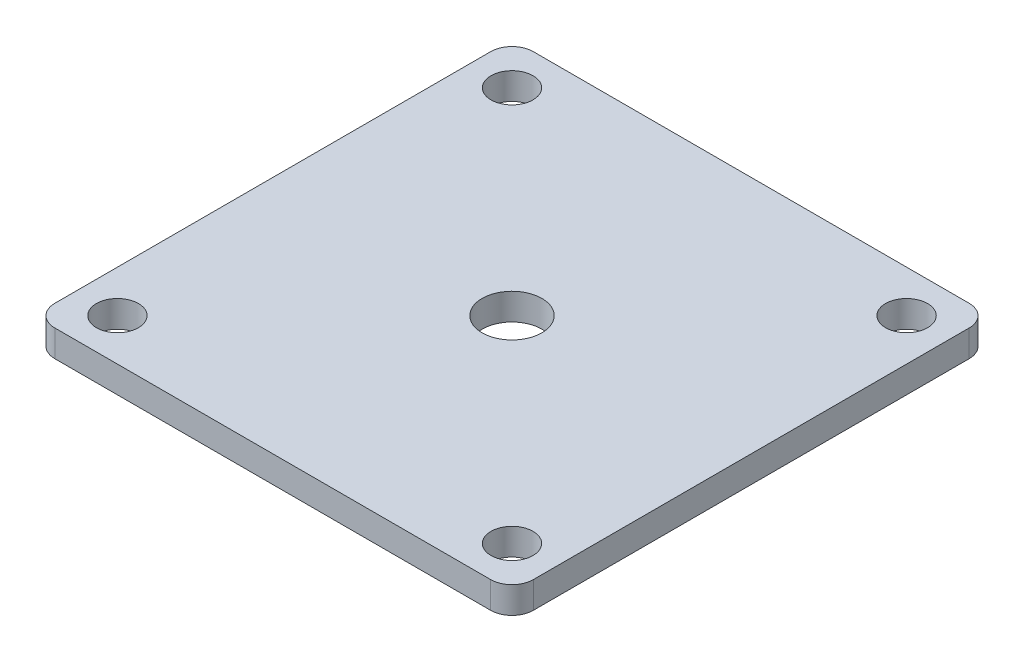
ISO-10303-21;
HEADER;
FILE_DESCRIPTION(('STEP AP214'),'2;1');
FILE_NAME('part.step','',(''),(''),'','','');
FILE_SCHEMA(('AUTOMOTIVE_DESIGN { 1 0 10303 214 1 1 1 1 }'));
ENDSEC;
DATA;
#1=APPLICATION_CONTEXT('core data for automotive mechanical design processes');
#2=APPLICATION_PROTOCOL_DEFINITION('international standard','automotive_design',2000,#1);
#3=PRODUCT_CONTEXT('',#1,'mechanical');
#4=PRODUCT('Part','Part','',(#3));
#5=PRODUCT_RELATED_PRODUCT_CATEGORY('part','',(#4));
#6=PRODUCT_DEFINITION_FORMATION('','',#4);
#7=PRODUCT_DEFINITION_CONTEXT('part definition',#1,'design');
#8=PRODUCT_DEFINITION('design','',#6,#7);
#9=PRODUCT_DEFINITION_SHAPE('','',#8);
#10=(LENGTH_UNIT() NAMED_UNIT(*) SI_UNIT(.MILLI.,.METRE.));
#11=(NAMED_UNIT(*) PLANE_ANGLE_UNIT() SI_UNIT($,.RADIAN.));
#12=(NAMED_UNIT(*) SI_UNIT($,.STERADIAN.) SOLID_ANGLE_UNIT());
#13=UNCERTAINTY_MEASURE_WITH_UNIT(LENGTH_MEASURE(1.E-05),#10,'distance_accuracy_value','');
#14=(GEOMETRIC_REPRESENTATION_CONTEXT(3) GLOBAL_UNCERTAINTY_ASSIGNED_CONTEXT((#13)) GLOBAL_UNIT_ASSIGNED_CONTEXT((#10,
#11,#12)) REPRESENTATION_CONTEXT('',''));
#15=CARTESIAN_POINT('',(0.,0.,0.));
#16=DIRECTION('',(0.,0.,1.));
#17=DIRECTION('',(1.,0.,0.));
#18=AXIS2_PLACEMENT_3D('',#15,#16,#17);
#19=CARTESIAN_POINT('',(25.9599938,3.175,-25.9599938));
#20=DIRECTION('',(0.,1.,0.));
#21=DIRECTION('',(0.,0.,1.));
#22=AXIS2_PLACEMENT_3D('',#19,#20,#21);
#23=PLANE('',#22);
#24=CARTESIAN_POINT('',(23.5000038000013,3.175,23.5000037999987));
#25=DIRECTION('',(0.,1.,0.));
#26=DIRECTION('',(0.,0.,1.));
#27=AXIS2_PLACEMENT_3D('',#24,#25,#26);
#28=CIRCLE('',#27,2.49999500000186);
#29=CARTESIAN_POINT('',(23.5000038000013,3.175,25.9999988000005));
#30=VERTEX_POINT('',#29);
#31=EDGE_CURVE('E198',#30,#30,#28,.T.);
#32=ORIENTED_EDGE('',*,*,#31,.F.);
#33=EDGE_LOOP('',(#32));
#34=FACE_BOUND('',#33,.T.);
#35=CARTESIAN_POINT('',(-23.5000038,3.175,-23.5000038));
#36=DIRECTION('',(0.,1.,0.));
#37=DIRECTION('',(0.,0.,1.));
#38=AXIS2_PLACEMENT_3D('',#35,#36,#37);
#39=CIRCLE('',#38,2.499995);
#40=CARTESIAN_POINT('',(-23.5000038,3.175,-21.0000088));
#41=VERTEX_POINT('',#40);
#42=EDGE_CURVE('E186',#41,#41,#39,.T.);
#43=ORIENTED_EDGE('',*,*,#42,.F.);
#44=EDGE_LOOP('',(#43));
#45=FACE_BOUND('',#44,.T.);
#46=DIRECTION('',(-1.,0.,0.));
#47=VECTOR('',#46,1.);
#48=CARTESIAN_POINT('',(-13.9933145966194,3.175,-28.4999938));
#49=LINE('',#48,#47);
#50=CARTESIAN_POINT('',(25.9599938,3.175,-28.4999938));
#51=VERTEX_POINT('',#50);
#52=CARTESIAN_POINT('',(-25.9599938,3.175,-28.4999938));
#53=VERTEX_POINT('',#52);
#54=EDGE_CURVE('E51',#51,#53,#49,.T.);
#55=ORIENTED_EDGE('',*,*,#54,.T.);
#56=CARTESIAN_POINT('',(-25.9599938,3.175,-25.9599938));
#57=DIRECTION('',(0.,1.,0.));
#58=DIRECTION('',(0.,0.,1.));
#59=AXIS2_PLACEMENT_3D('',#56,#57,#58);
#60=CIRCLE('',#59,2.54);
#61=CARTESIAN_POINT('',(-28.4999938,3.175,-25.9599938));
#62=VERTEX_POINT('',#61);
#63=EDGE_CURVE('E164',#53,#62,#60,.T.);
#64=ORIENTED_EDGE('',*,*,#63,.T.);
#65=DIRECTION('',(0.,0.,1.));
#66=VECTOR('',#65,1.);
#67=CARTESIAN_POINT('',(-28.4999938,3.175,-13.9933145966194));
#68=LINE('',#67,#66);
#69=CARTESIAN_POINT('',(-28.4999938,3.175,25.9599938));
#70=VERTEX_POINT('',#69);
#71=EDGE_CURVE('E161',#62,#70,#68,.T.);
#72=ORIENTED_EDGE('',*,*,#71,.T.);
#73=CARTESIAN_POINT('',(-25.9599938,3.175,25.9599938));
#74=DIRECTION('',(0.,1.,0.));
#75=DIRECTION('',(0.,0.,-1.));
#76=AXIS2_PLACEMENT_3D('',#73,#74,#75);
#77=CIRCLE('',#76,2.54);
#78=CARTESIAN_POINT('',(-25.9599938,3.175,28.4999938));
#79=VERTEX_POINT('',#78);
#80=EDGE_CURVE('E177',#70,#79,#77,.T.);
#81=ORIENTED_EDGE('',*,*,#80,.T.);
#82=DIRECTION('',(1.,0.,0.));
#83=VECTOR('',#82,1.);
#84=CARTESIAN_POINT('',(-13.9933145966194,3.175,28.4999938));
#85=LINE('',#84,#83);
#86=CARTESIAN_POINT('',(25.9599938,3.175,28.4999938));
#87=VERTEX_POINT('',#86);
#88=EDGE_CURVE('E110',#79,#87,#85,.T.);
#89=ORIENTED_EDGE('',*,*,#88,.T.);
#90=CARTESIAN_POINT('',(25.9599938,3.175,25.9599938));
#91=DIRECTION('',(0.,1.,0.));
#92=DIRECTION('',(0.,0.,1.));
#93=AXIS2_PLACEMENT_3D('',#90,#91,#92);
#94=CIRCLE('',#93,2.54);
#95=CARTESIAN_POINT('',(28.4999938,3.175,25.9599938));
#96=VERTEX_POINT('',#95);
#97=EDGE_CURVE('E104',#87,#96,#94,.T.);
#98=ORIENTED_EDGE('',*,*,#97,.T.);
#99=DIRECTION('',(0.,0.,-1.));
#100=VECTOR('',#99,1.);
#101=CARTESIAN_POINT('',(28.4999938,3.175,25.9599938));
#102=LINE('',#101,#100);
#103=CARTESIAN_POINT('',(28.4999938,3.175,-25.9599938));
#104=VERTEX_POINT('',#103);
#105=EDGE_CURVE('E108',#96,#104,#102,.T.);
#106=ORIENTED_EDGE('',*,*,#105,.T.);
#107=CARTESIAN_POINT('',(25.9599938,3.175,-25.9599938));
#108=DIRECTION('',(0.,1.,0.));
#109=DIRECTION('',(0.,0.,1.));
#110=AXIS2_PLACEMENT_3D('',#107,#108,#109);
#111=CIRCLE('',#110,2.54);
#112=EDGE_CURVE('E125',#104,#51,#111,.T.);
#113=ORIENTED_EDGE('',*,*,#112,.T.);
#114=EDGE_LOOP('',(#55,#64,#72,#81,#89,#98,#106,#113));
#115=FACE_BOUND('',#114,.T.);
#116=CARTESIAN_POINT('',(0.,3.175,0.));
#117=DIRECTION('',(0.,1.,0.));
#118=DIRECTION('',(0.,0.,1.));
#119=AXIS2_PLACEMENT_3D('',#116,#117,#118);
#120=CIRCLE('',#119,3.556);
#121=CARTESIAN_POINT('',(0.,3.175,3.556));
#122=VERTEX_POINT('',#121);
#123=EDGE_CURVE('E135',#122,#122,#120,.T.);
#124=ORIENTED_EDGE('',*,*,#123,.F.);
#125=EDGE_LOOP('',(#124));
#126=FACE_BOUND('',#125,.T.);
#127=CARTESIAN_POINT('',(23.5000038,3.175,-23.5000038000013));
#128=DIRECTION('',(0.,1.,0.));
#129=DIRECTION('',(0.,0.,1.));
#130=AXIS2_PLACEMENT_3D('',#127,#128,#129);
#131=CIRCLE('',#130,2.49999500000137);
#132=CARTESIAN_POINT('',(23.5000038,3.175,-21.0000088));
#133=VERTEX_POINT('',#132);
#134=EDGE_CURVE('E192',#133,#133,#131,.T.);
#135=ORIENTED_EDGE('',*,*,#134,.F.);
#136=EDGE_LOOP('',(#135));
#137=FACE_BOUND('',#136,.T.);
#138=CARTESIAN_POINT('',(-23.5000037999987,3.175,23.5000038));
#139=DIRECTION('',(0.,1.,0.));
#140=DIRECTION('',(0.,0.,1.));
#141=AXIS2_PLACEMENT_3D('',#138,#139,#140);
#142=CIRCLE('',#141,2.49999500000069);
#143=CARTESIAN_POINT('',(-23.5000037999987,3.175,25.9999988000007));
#144=VERTEX_POINT('',#143);
#145=EDGE_CURVE('E204',#144,#144,#142,.T.);
#146=ORIENTED_EDGE('',*,*,#145,.F.);
#147=EDGE_LOOP('',(#146));
#148=FACE_BOUND('',#147,.T.);
#149=ADVANCED_FACE('F34',(#34,#45,#115,#126,#137,#148),#23,.T.);
#150=CARTESIAN_POINT('',(25.9599938,0.,-25.9599938));
#151=DIRECTION('',(0.,1.,0.));
#152=DIRECTION('',(0.,0.,1.));
#153=AXIS2_PLACEMENT_3D('',#150,#151,#152);
#154=PLANE('',#153);
#155=CARTESIAN_POINT('',(-25.9599938,0.,-25.9599938));
#156=DIRECTION('',(0.,1.,0.));
#157=DIRECTION('',(0.,0.,1.));
#158=AXIS2_PLACEMENT_3D('',#155,#156,#157);
#159=CIRCLE('',#158,2.54);
#160=CARTESIAN_POINT('',(-25.9599938,0.,-28.4999938));
#161=VERTEX_POINT('',#160);
#162=CARTESIAN_POINT('',(-28.4999938,0.,-25.9599938));
#163=VERTEX_POINT('',#162);
#164=EDGE_CURVE('E131',#161,#163,#159,.T.);
#165=ORIENTED_EDGE('',*,*,#164,.F.);
#166=DIRECTION('',(-1.,0.,0.));
#167=VECTOR('',#166,1.);
#168=CARTESIAN_POINT('',(25.9599938,0.,-28.4999938));
#169=LINE('',#168,#167);
#170=CARTESIAN_POINT('',(25.9599938,0.,-28.4999938));
#171=VERTEX_POINT('',#170);
#172=EDGE_CURVE('E145',#171,#161,#169,.T.);
#173=ORIENTED_EDGE('',*,*,#172,.F.);
#174=CARTESIAN_POINT('',(25.9599938,0.,-25.9599938));
#175=DIRECTION('',(0.,1.,0.));
#176=DIRECTION('',(0.,0.,1.));
#177=AXIS2_PLACEMENT_3D('',#174,#175,#176);
#178=CIRCLE('',#177,2.54);
#179=CARTESIAN_POINT('',(28.4999938,0.,-25.9599938));
#180=VERTEX_POINT('',#179);
#181=EDGE_CURVE('E87',#180,#171,#178,.T.);
#182=ORIENTED_EDGE('',*,*,#181,.F.);
#183=DIRECTION('',(0.,0.,-1.));
#184=VECTOR('',#183,1.);
#185=CARTESIAN_POINT('',(28.4999938,0.,-13.9933145966194));
#186=LINE('',#185,#184);
#187=CARTESIAN_POINT('',(28.4999938,0.,25.9599938));
#188=VERTEX_POINT('',#187);
#189=EDGE_CURVE('E80',#188,#180,#186,.T.);
#190=ORIENTED_EDGE('',*,*,#189,.F.);
#191=CARTESIAN_POINT('',(25.9599938,0.,25.9599938));
#192=DIRECTION('',(0.,1.,0.));
#193=DIRECTION('',(0.,0.,1.));
#194=AXIS2_PLACEMENT_3D('',#191,#192,#193);
#195=CIRCLE('',#194,2.54);
#196=CARTESIAN_POINT('',(25.9599938,0.,28.4999938));
#197=VERTEX_POINT('',#196);
#198=EDGE_CURVE('E119',#197,#188,#195,.T.);
#199=ORIENTED_EDGE('',*,*,#198,.F.);
#200=DIRECTION('',(1.,0.,0.));
#201=VECTOR('',#200,1.);
#202=CARTESIAN_POINT('',(25.9599938,0.,28.4999938));
#203=LINE('',#202,#201);
#204=CARTESIAN_POINT('',(-25.9599938,0.,28.4999938));
#205=VERTEX_POINT('',#204);
#206=EDGE_CURVE('E140',#205,#197,#203,.T.);
#207=ORIENTED_EDGE('',*,*,#206,.F.);
#208=CARTESIAN_POINT('',(-25.9599938,0.,25.9599938));
#209=DIRECTION('',(0.,1.,0.));
#210=DIRECTION('',(0.,0.,-1.));
#211=AXIS2_PLACEMENT_3D('',#208,#209,#210);
#212=CIRCLE('',#211,2.54);
#213=CARTESIAN_POINT('',(-28.4999938,0.,25.9599938));
#214=VERTEX_POINT('',#213);
#215=EDGE_CURVE('E137',#214,#205,#212,.T.);
#216=ORIENTED_EDGE('',*,*,#215,.F.);
#217=DIRECTION('',(0.,0.,1.));
#218=VECTOR('',#217,1.);
#219=CARTESIAN_POINT('',(-28.4999938,0.,25.9599938));
#220=LINE('',#219,#218);
#221=EDGE_CURVE('E134',#163,#214,#220,.T.);
#222=ORIENTED_EDGE('',*,*,#221,.F.);
#223=EDGE_LOOP('',(#165,#173,#182,#190,#199,#207,#216,#222));
#224=FACE_BOUND('',#223,.T.);
#225=CARTESIAN_POINT('',(0.,0.,0.));
#226=DIRECTION('',(0.,1.,0.));
#227=DIRECTION('',(0.,0.,1.));
#228=AXIS2_PLACEMENT_3D('',#225,#226,#227);
#229=CIRCLE('',#228,3.556);
#230=CARTESIAN_POINT('',(0.,0.,3.556));
#231=VERTEX_POINT('',#230);
#232=EDGE_CURVE('E183',#231,#231,#229,.T.);
#233=ORIENTED_EDGE('',*,*,#232,.T.);
#234=EDGE_LOOP('',(#233));
#235=FACE_BOUND('',#234,.T.);
#236=CARTESIAN_POINT('',(-23.5000038,0.,-23.5000038));
#237=DIRECTION('',(0.,1.,0.));
#238=DIRECTION('',(0.,0.,1.));
#239=AXIS2_PLACEMENT_3D('',#236,#237,#238);
#240=CIRCLE('',#239,2.499995);
#241=CARTESIAN_POINT('',(-23.5000038,0.,-21.0000088));
#242=VERTEX_POINT('',#241);
#243=EDGE_CURVE('E189',#242,#242,#240,.T.);
#244=ORIENTED_EDGE('',*,*,#243,.T.);
#245=EDGE_LOOP('',(#244));
#246=FACE_BOUND('',#245,.T.);
#247=CARTESIAN_POINT('',(23.5000038,0.,-23.5000038000013));
#248=DIRECTION('',(0.,1.,0.));
#249=DIRECTION('',(0.,0.,1.));
#250=AXIS2_PLACEMENT_3D('',#247,#248,#249);
#251=CIRCLE('',#250,2.49999500000137);
#252=CARTESIAN_POINT('',(23.5000038,0.,-21.0000088));
#253=VERTEX_POINT('',#252);
#254=EDGE_CURVE('E195',#253,#253,#251,.T.);
#255=ORIENTED_EDGE('',*,*,#254,.T.);
#256=EDGE_LOOP('',(#255));
#257=FACE_BOUND('',#256,.T.);
#258=CARTESIAN_POINT('',(23.5000038000013,0.,23.5000037999987));
#259=DIRECTION('',(0.,1.,0.));
#260=DIRECTION('',(0.,0.,1.));
#261=AXIS2_PLACEMENT_3D('',#258,#259,#260);
#262=CIRCLE('',#261,2.49999500000186);
#263=CARTESIAN_POINT('',(23.5000038000013,0.,25.9999988000005));
#264=VERTEX_POINT('',#263);
#265=EDGE_CURVE('E201',#264,#264,#262,.T.);
#266=ORIENTED_EDGE('',*,*,#265,.T.);
#267=EDGE_LOOP('',(#266));
#268=FACE_BOUND('',#267,.T.);
#269=CARTESIAN_POINT('',(-23.5000037999987,0.,23.5000038));
#270=DIRECTION('',(0.,1.,0.));
#271=DIRECTION('',(0.,0.,1.));
#272=AXIS2_PLACEMENT_3D('',#269,#270,#271);
#273=CIRCLE('',#272,2.49999500000069);
#274=CARTESIAN_POINT('',(-23.5000037999987,0.,25.9999988000007));
#275=VERTEX_POINT('',#274);
#276=EDGE_CURVE('E207',#275,#275,#273,.T.);
#277=ORIENTED_EDGE('',*,*,#276,.T.);
#278=EDGE_LOOP('',(#277));
#279=FACE_BOUND('',#278,.T.);
#280=ADVANCED_FACE('F168',(#224,#235,#246,#257,#268,#279),#154,.F.);
#281=CARTESIAN_POINT('',(-25.9599938,3.175,-25.9599938));
#282=DIRECTION('',(0.,-1.,0.));
#283=DIRECTION('',(0.,0.,-1.));
#284=AXIS2_PLACEMENT_3D('',#281,#282,#283);
#285=CYLINDRICAL_SURFACE('',#284,2.54);
#286=ORIENTED_EDGE('',*,*,#164,.T.);
#287=DIRECTION('',(0.,-1.,0.));
#288=VECTOR('',#287,1.);
#289=CARTESIAN_POINT('',(-28.4999938,3.175,-25.9599938));
#290=LINE('',#289,#288);
#291=EDGE_CURVE('E43',#62,#163,#290,.T.);
#292=ORIENTED_EDGE('',*,*,#291,.F.);
#293=ORIENTED_EDGE('',*,*,#63,.F.);
#294=DIRECTION('',(0.,-1.,0.));
#295=VECTOR('',#294,1.);
#296=CARTESIAN_POINT('',(-25.9599938,3.175,-28.4999938));
#297=LINE('',#296,#295);
#298=EDGE_CURVE('E11',#53,#161,#297,.T.);
#299=ORIENTED_EDGE('',*,*,#298,.T.);
#300=EDGE_LOOP('',(#286,#292,#293,#299));
#301=FACE_BOUND('',#300,.T.);
#302=ADVANCED_FACE('F36',(#301),#285,.T.);
#303=CARTESIAN_POINT('',(-28.4999938,3.175,25.9599938));
#304=DIRECTION('',(1.,0.,0.));
#305=DIRECTION('',(0.,0.,-1.));
#306=AXIS2_PLACEMENT_3D('',#303,#304,#305);
#307=PLANE('',#306);
#308=ORIENTED_EDGE('',*,*,#221,.T.);
#309=DIRECTION('',(0.,-1.,0.));
#310=VECTOR('',#309,1.);
#311=CARTESIAN_POINT('',(-28.4999938,3.175,25.9599938));
#312=LINE('',#311,#310);
#313=EDGE_CURVE('E153',#70,#214,#312,.T.);
#314=ORIENTED_EDGE('',*,*,#313,.F.);
#315=ORIENTED_EDGE('',*,*,#71,.F.);
#316=ORIENTED_EDGE('',*,*,#291,.T.);
#317=EDGE_LOOP('',(#308,#314,#315,#316));
#318=FACE_BOUND('',#317,.T.);
#319=ADVANCED_FACE('F159',(#318),#307,.F.);
#320=CARTESIAN_POINT('',(-25.9599938,3.175,25.9599938));
#321=DIRECTION('',(0.,-1.,0.));
#322=DIRECTION('',(0.,0.,-1.));
#323=AXIS2_PLACEMENT_3D('',#320,#321,#322);
#324=CYLINDRICAL_SURFACE('',#323,2.54);
#325=ORIENTED_EDGE('',*,*,#215,.T.);
#326=DIRECTION('',(0.,-1.,0.));
#327=VECTOR('',#326,1.);
#328=CARTESIAN_POINT('',(-25.9599938,3.175,28.4999938));
#329=LINE('',#328,#327);
#330=EDGE_CURVE('E150',#79,#205,#329,.T.);
#331=ORIENTED_EDGE('',*,*,#330,.F.);
#332=ORIENTED_EDGE('',*,*,#80,.F.);
#333=ORIENTED_EDGE('',*,*,#313,.T.);
#334=EDGE_LOOP('',(#325,#331,#332,#333));
#335=FACE_BOUND('',#334,.T.);
#336=ADVANCED_FACE('F173',(#335),#324,.T.);
#337=CARTESIAN_POINT('',(25.9599938,3.175,28.4999938));
#338=DIRECTION('',(0.,0.,-1.));
#339=DIRECTION('',(-1.,0.,0.));
#340=AXIS2_PLACEMENT_3D('',#337,#338,#339);
#341=PLANE('',#340);
#342=ORIENTED_EDGE('',*,*,#206,.T.);
#343=DIRECTION('',(0.,-1.,0.));
#344=VECTOR('',#343,1.);
#345=CARTESIAN_POINT('',(25.9599938,3.175,28.4999938));
#346=LINE('',#345,#344);
#347=EDGE_CURVE('E120',#87,#197,#346,.T.);
#348=ORIENTED_EDGE('',*,*,#347,.F.);
#349=ORIENTED_EDGE('',*,*,#88,.F.);
#350=ORIENTED_EDGE('',*,*,#330,.T.);
#351=EDGE_LOOP('',(#342,#348,#349,#350));
#352=FACE_BOUND('',#351,.T.);
#353=ADVANCED_FACE('F176',(#352),#341,.F.);
#354=CARTESIAN_POINT('',(25.9599938,3.175,25.9599938));
#355=DIRECTION('',(0.,-1.,0.));
#356=DIRECTION('',(0.,0.,-1.));
#357=AXIS2_PLACEMENT_3D('',#354,#355,#356);
#358=CYLINDRICAL_SURFACE('',#357,2.54);
#359=ORIENTED_EDGE('',*,*,#198,.T.);
#360=DIRECTION('',(0.,-1.,0.));
#361=VECTOR('',#360,1.);
#362=CARTESIAN_POINT('',(28.4999938,3.175,25.9599938));
#363=LINE('',#362,#361);
#364=EDGE_CURVE('E116',#96,#188,#363,.T.);
#365=ORIENTED_EDGE('',*,*,#364,.F.);
#366=ORIENTED_EDGE('',*,*,#97,.F.);
#367=ORIENTED_EDGE('',*,*,#347,.T.);
#368=EDGE_LOOP('',(#359,#365,#366,#367));
#369=FACE_BOUND('',#368,.T.);
#370=ADVANCED_FACE('F117',(#369),#358,.T.);
#371=CARTESIAN_POINT('',(28.4999938,3.175,-13.9933145966194));
#372=DIRECTION('',(-1.,0.,0.));
#373=DIRECTION('',(0.,0.,1.));
#374=AXIS2_PLACEMENT_3D('',#371,#372,#373);
#375=PLANE('',#374);
#376=ORIENTED_EDGE('',*,*,#189,.T.);
#377=DIRECTION('',(0.,-1.,0.));
#378=VECTOR('',#377,1.);
#379=CARTESIAN_POINT('',(28.4999938,3.175,-25.9599938));
#380=LINE('',#379,#378);
#381=EDGE_CURVE('E121',#104,#180,#380,.T.);
#382=ORIENTED_EDGE('',*,*,#381,.F.);
#383=ORIENTED_EDGE('',*,*,#105,.F.);
#384=ORIENTED_EDGE('',*,*,#364,.T.);
#385=EDGE_LOOP('',(#376,#382,#383,#384));
#386=FACE_BOUND('',#385,.T.);
#387=ADVANCED_FACE('F123',(#386),#375,.F.);
#388=CARTESIAN_POINT('',(25.9599938,3.175,-25.9599938));
#389=DIRECTION('',(0.,-1.,0.));
#390=DIRECTION('',(0.,0.,-1.));
#391=AXIS2_PLACEMENT_3D('',#388,#389,#390);
#392=CYLINDRICAL_SURFACE('',#391,2.54);
#393=ORIENTED_EDGE('',*,*,#181,.T.);
#394=DIRECTION('',(0.,-1.,0.));
#395=VECTOR('',#394,1.);
#396=CARTESIAN_POINT('',(25.9599938,3.175,-28.4999938));
#397=LINE('',#396,#395);
#398=EDGE_CURVE('E127',#51,#171,#397,.T.);
#399=ORIENTED_EDGE('',*,*,#398,.F.);
#400=ORIENTED_EDGE('',*,*,#112,.F.);
#401=ORIENTED_EDGE('',*,*,#381,.T.);
#402=EDGE_LOOP('',(#393,#399,#400,#401));
#403=FACE_BOUND('',#402,.T.);
#404=ADVANCED_FACE('F232',(#403),#392,.T.);
#405=CARTESIAN_POINT('',(25.9599938,3.175,-28.4999938));
#406=DIRECTION('',(0.,0.,1.));
#407=DIRECTION('',(1.,0.,0.));
#408=AXIS2_PLACEMENT_3D('',#405,#406,#407);
#409=PLANE('',#408);
#410=ORIENTED_EDGE('',*,*,#172,.T.);
#411=ORIENTED_EDGE('',*,*,#298,.F.);
#412=ORIENTED_EDGE('',*,*,#54,.F.);
#413=ORIENTED_EDGE('',*,*,#398,.T.);
#414=EDGE_LOOP('',(#410,#411,#412,#413));
#415=FACE_BOUND('',#414,.T.);
#416=ADVANCED_FACE('F229',(#415),#409,.F.);
#417=CARTESIAN_POINT('',(0.,3.175,0.));
#418=DIRECTION('',(0.,-1.,0.));
#419=DIRECTION('',(0.,0.,-1.));
#420=AXIS2_PLACEMENT_3D('',#417,#418,#419);
#421=CYLINDRICAL_SURFACE('',#420,3.556);
#422=ORIENTED_EDGE('',*,*,#123,.T.);
#423=EDGE_LOOP('',(#422));
#424=FACE_BOUND('',#423,.T.);
#425=ORIENTED_EDGE('',*,*,#232,.F.);
#426=EDGE_LOOP('',(#425));
#427=FACE_BOUND('',#426,.T.);
#428=ADVANCED_FACE('F226',(#424,#427),#421,.F.);
#429=CARTESIAN_POINT('',(-23.5000038,3.175,-23.5000038));
#430=DIRECTION('',(0.,-1.,0.));
#431=DIRECTION('',(0.,0.,-1.));
#432=AXIS2_PLACEMENT_3D('',#429,#430,#431);
#433=CYLINDRICAL_SURFACE('',#432,2.499995);
#434=ORIENTED_EDGE('',*,*,#42,.T.);
#435=EDGE_LOOP('',(#434));
#436=FACE_BOUND('',#435,.T.);
#437=ORIENTED_EDGE('',*,*,#243,.F.);
#438=EDGE_LOOP('',(#437));
#439=FACE_BOUND('',#438,.T.);
#440=ADVANCED_FACE('F326',(#436,#439),#433,.F.);
#441=CARTESIAN_POINT('',(23.5000038,3.175,-23.5000038000013));
#442=DIRECTION('',(0.,-1.,0.));
#443=DIRECTION('',(0.,0.,-1.));
#444=AXIS2_PLACEMENT_3D('',#441,#442,#443);
#445=CYLINDRICAL_SURFACE('',#444,2.49999500000137);
#446=ORIENTED_EDGE('',*,*,#134,.T.);
#447=EDGE_LOOP('',(#446));
#448=FACE_BOUND('',#447,.T.);
#449=ORIENTED_EDGE('',*,*,#254,.F.);
#450=EDGE_LOOP('',(#449));
#451=FACE_BOUND('',#450,.T.);
#452=ADVANCED_FACE('F334',(#448,#451),#445,.F.);
#453=CARTESIAN_POINT('',(23.5000038000013,3.175,23.5000037999987));
#454=DIRECTION('',(0.,-1.,0.));
#455=DIRECTION('',(0.,0.,-1.));
#456=AXIS2_PLACEMENT_3D('',#453,#454,#455);
#457=CYLINDRICAL_SURFACE('',#456,2.49999500000186);
#458=ORIENTED_EDGE('',*,*,#31,.T.);
#459=EDGE_LOOP('',(#458));
#460=FACE_BOUND('',#459,.T.);
#461=ORIENTED_EDGE('',*,*,#265,.F.);
#462=EDGE_LOOP('',(#461));
#463=FACE_BOUND('',#462,.T.);
#464=ADVANCED_FACE('F342',(#460,#463),#457,.F.);
#465=CARTESIAN_POINT('',(-23.5000037999987,3.175,23.5000038));
#466=DIRECTION('',(0.,-1.,0.));
#467=DIRECTION('',(0.,0.,-1.));
#468=AXIS2_PLACEMENT_3D('',#465,#466,#467);
#469=CYLINDRICAL_SURFACE('',#468,2.49999500000069);
#470=ORIENTED_EDGE('',*,*,#145,.T.);
#471=EDGE_LOOP('',(#470));
#472=FACE_BOUND('',#471,.T.);
#473=ORIENTED_EDGE('',*,*,#276,.F.);
#474=EDGE_LOOP('',(#473));
#475=FACE_BOUND('',#474,.T.);
#476=ADVANCED_FACE('F213',(#472,#475),#469,.F.);
#477=CLOSED_SHELL('',(#149,#280,#302,#319,#336,#353,#370,#387,#404,#416,#428,#440,#452,#464,#476));
#478=MANIFOLD_SOLID_BREP('B2',#477);
#479=ADVANCED_BREP_SHAPE_REPRESENTATION('',(#18,#478),#14);
#480=SHAPE_DEFINITION_REPRESENTATION(#9,#479);
ENDSEC;
END-ISO-10303-21;
